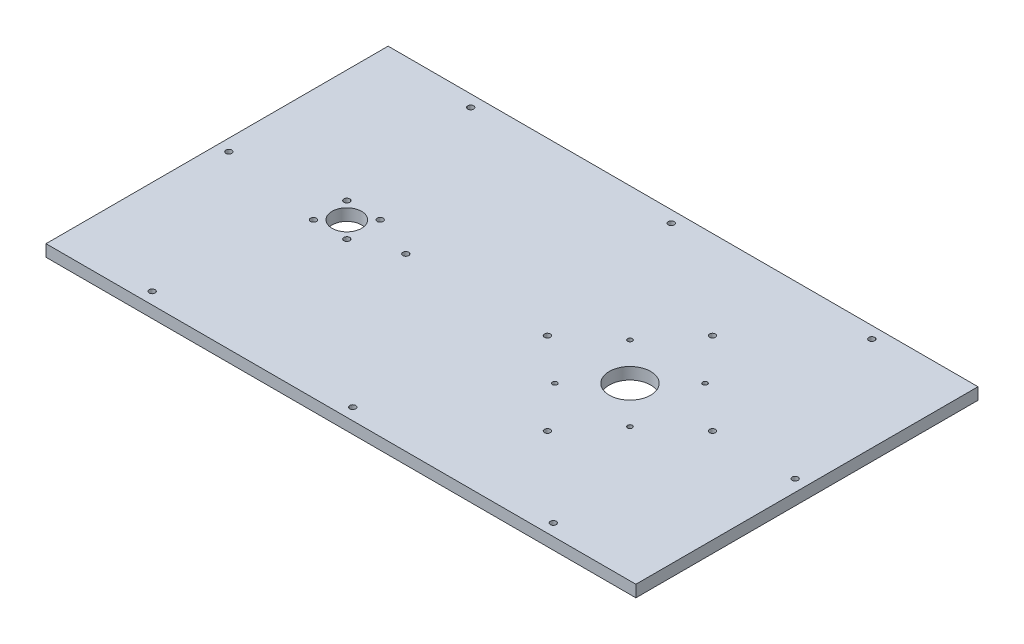
ISO-10303-21;
HEADER;
FILE_DESCRIPTION(('STEP AP214'),'2;1');
FILE_NAME('part.step','',(''),(''),'','','');
FILE_SCHEMA(('AUTOMOTIVE_DESIGN { 1 0 10303 214 1 1 1 1 }'));
ENDSEC;
DATA;
#1=APPLICATION_CONTEXT('core data for automotive mechanical design processes');
#2=APPLICATION_PROTOCOL_DEFINITION('international standard','automotive_design',2000,#1);
#3=PRODUCT_CONTEXT('',#1,'mechanical');
#4=PRODUCT('Part','Part','',(#3));
#5=PRODUCT_RELATED_PRODUCT_CATEGORY('part','',(#4));
#6=PRODUCT_DEFINITION_FORMATION('','',#4);
#7=PRODUCT_DEFINITION_CONTEXT('part definition',#1,'design');
#8=PRODUCT_DEFINITION('design','',#6,#7);
#9=PRODUCT_DEFINITION_SHAPE('','',#8);
#10=(LENGTH_UNIT() NAMED_UNIT(*) SI_UNIT(.MILLI.,.METRE.));
#11=(NAMED_UNIT(*) PLANE_ANGLE_UNIT() SI_UNIT($,.RADIAN.));
#12=(NAMED_UNIT(*) SI_UNIT($,.STERADIAN.) SOLID_ANGLE_UNIT());
#13=UNCERTAINTY_MEASURE_WITH_UNIT(LENGTH_MEASURE(1.E-05),#10,'distance_accuracy_value','');
#14=(GEOMETRIC_REPRESENTATION_CONTEXT(3) GLOBAL_UNCERTAINTY_ASSIGNED_CONTEXT((#13)) GLOBAL_UNIT_ASSIGNED_CONTEXT((#10,
#11,#12)) REPRESENTATION_CONTEXT('',''));
#15=CARTESIAN_POINT('',(0.,0.,0.));
#16=DIRECTION('',(0.,0.,1.));
#17=DIRECTION('',(1.,0.,0.));
#18=AXIS2_PLACEMENT_3D('',#15,#16,#17);
#19=CARTESIAN_POINT('',(0.,10.,0.));
#20=DIRECTION('',(0.,-1.,0.));
#21=DIRECTION('',(0.,0.,-1.));
#22=AXIS2_PLACEMENT_3D('',#19,#20,#21);
#23=PLANE('',#22);
#24=DIRECTION('',(0.,0.,-1.));
#25=VECTOR('',#24,1.);
#26=CARTESIAN_POINT('',(250.,10.,145.));
#27=LINE('',#26,#25);
#28=CARTESIAN_POINT('',(250.,10.,145.));
#29=VERTEX_POINT('',#28);
#30=CARTESIAN_POINT('',(250.,10.,-145.));
#31=VERTEX_POINT('',#30);
#32=EDGE_CURVE('E85',#29,#31,#27,.T.);
#33=ORIENTED_EDGE('',*,*,#32,.T.);
#34=DIRECTION('',(-1.,0.,0.));
#35=VECTOR('',#34,1.);
#36=CARTESIAN_POINT('',(-250.,10.,-145.));
#37=LINE('',#36,#35);
#38=CARTESIAN_POINT('',(-250.,10.,-145.));
#39=VERTEX_POINT('',#38);
#40=EDGE_CURVE('E80',#31,#39,#37,.T.);
#41=ORIENTED_EDGE('',*,*,#40,.T.);
#42=DIRECTION('',(0.,0.,1.));
#43=VECTOR('',#42,1.);
#44=CARTESIAN_POINT('',(-250.,10.,145.));
#45=LINE('',#44,#43);
#46=CARTESIAN_POINT('',(-250.,10.,145.));
#47=VERTEX_POINT('',#46);
#48=EDGE_CURVE('E83',#39,#47,#45,.T.);
#49=ORIENTED_EDGE('',*,*,#48,.T.);
#50=DIRECTION('',(1.,0.,0.));
#51=VECTOR('',#50,1.);
#52=CARTESIAN_POINT('',(-250.,10.,145.));
#53=LINE('',#52,#51);
#54=EDGE_CURVE('E50',#47,#29,#53,.T.);
#55=ORIENTED_EDGE('',*,*,#54,.T.);
#56=EDGE_LOOP('',(#33,#41,#49,#55));
#57=FACE_BOUND('',#56,.T.);
#58=CARTESIAN_POINT('',(-240.,10.,0.));
#59=DIRECTION('',(0.,1.,0.));
#60=DIRECTION('',(0.,0.,1.));
#61=AXIS2_PLACEMENT_3D('',#58,#59,#60);
#62=CIRCLE('',#61,2.5);
#63=CARTESIAN_POINT('',(-240.,10.,2.5));
#64=VERTEX_POINT('',#63);
#65=EDGE_CURVE('E100',#64,#64,#62,.T.);
#66=ORIENTED_EDGE('',*,*,#65,.F.);
#67=EDGE_LOOP('',(#66));
#68=FACE_BOUND('',#67,.T.);
#69=CARTESIAN_POINT('',(-89.9999999999999,10.,0.));
#70=DIRECTION('',(0.,1.,0.));
#71=DIRECTION('',(0.,0.,1.));
#72=AXIS2_PLACEMENT_3D('',#69,#70,#71);
#73=CIRCLE('',#72,2.5);
#74=CARTESIAN_POINT('',(-89.9999999999999,10.,2.5));
#75=VERTEX_POINT('',#74);
#76=EDGE_CURVE('E115',#75,#75,#73,.T.);
#77=ORIENTED_EDGE('',*,*,#76,.F.);
#78=EDGE_LOOP('',(#77));
#79=FACE_BOUND('',#78,.T.);
#80=CARTESIAN_POINT('',(-170.,10.,135.));
#81=DIRECTION('',(0.,1.,0.));
#82=DIRECTION('',(0.,0.,1.));
#83=AXIS2_PLACEMENT_3D('',#80,#81,#82);
#84=CIRCLE('',#83,2.5);
#85=CARTESIAN_POINT('',(-170.,10.,137.5));
#86=VERTEX_POINT('',#85);
#87=EDGE_CURVE('E121',#86,#86,#84,.T.);
#88=ORIENTED_EDGE('',*,*,#87,.F.);
#89=EDGE_LOOP('',(#88));
#90=FACE_BOUND('',#89,.T.);
#91=CARTESIAN_POINT('',(-170.,10.,-135.));
#92=DIRECTION('',(0.,1.,0.));
#93=DIRECTION('',(0.,0.,1.));
#94=AXIS2_PLACEMENT_3D('',#91,#92,#93);
#95=CIRCLE('',#94,2.5);
#96=CARTESIAN_POINT('',(-170.,10.,-132.5));
#97=VERTEX_POINT('',#96);
#98=EDGE_CURVE('E127',#97,#97,#95,.T.);
#99=ORIENTED_EDGE('',*,*,#98,.F.);
#100=EDGE_LOOP('',(#99));
#101=FACE_BOUND('',#100,.T.);
#102=CARTESIAN_POINT('',(170.,10.,-135.));
#103=DIRECTION('',(0.,1.,0.));
#104=DIRECTION('',(0.,0.,1.));
#105=AXIS2_PLACEMENT_3D('',#102,#103,#104);
#106=CIRCLE('',#105,2.5);
#107=CARTESIAN_POINT('',(170.,10.,-132.5));
#108=VERTEX_POINT('',#107);
#109=EDGE_CURVE('E133',#108,#108,#106,.T.);
#110=ORIENTED_EDGE('',*,*,#109,.F.);
#111=EDGE_LOOP('',(#110));
#112=FACE_BOUND('',#111,.T.);
#113=CARTESIAN_POINT('',(240.,10.,0.));
#114=DIRECTION('',(0.,1.,0.));
#115=DIRECTION('',(0.,0.,1.));
#116=AXIS2_PLACEMENT_3D('',#113,#114,#115);
#117=CIRCLE('',#116,2.5);
#118=CARTESIAN_POINT('',(240.,10.,2.5));
#119=VERTEX_POINT('',#118);
#120=EDGE_CURVE('E139',#119,#119,#117,.T.);
#121=ORIENTED_EDGE('',*,*,#120,.F.);
#122=EDGE_LOOP('',(#121));
#123=FACE_BOUND('',#122,.T.);
#124=CARTESIAN_POINT('',(170.,10.,135.));
#125=DIRECTION('',(0.,1.,0.));
#126=DIRECTION('',(0.,0.,1.));
#127=AXIS2_PLACEMENT_3D('',#124,#125,#126);
#128=CIRCLE('',#127,2.5);
#129=CARTESIAN_POINT('',(170.,10.,137.5));
#130=VERTEX_POINT('',#129);
#131=EDGE_CURVE('E145',#130,#130,#128,.T.);
#132=ORIENTED_EDGE('',*,*,#131,.F.);
#133=EDGE_LOOP('',(#132));
#134=FACE_BOUND('',#133,.T.);
#135=CARTESIAN_POINT('',(1.11022302462516E-13,10.,-135.));
#136=DIRECTION('',(0.,1.,0.));
#137=DIRECTION('',(0.,0.,1.));
#138=AXIS2_PLACEMENT_3D('',#135,#136,#137);
#139=CIRCLE('',#138,2.5);
#140=CARTESIAN_POINT('',(1.11022302462516E-13,10.,-132.5));
#141=VERTEX_POINT('',#140);
#142=EDGE_CURVE('E151',#141,#141,#139,.T.);
#143=ORIENTED_EDGE('',*,*,#142,.F.);
#144=EDGE_LOOP('',(#143));
#145=FACE_BOUND('',#144,.T.);
#146=CARTESIAN_POINT('',(1.11022302462516E-13,10.,135.));
#147=DIRECTION('',(0.,1.,0.));
#148=DIRECTION('',(0.,0.,1.));
#149=AXIS2_PLACEMENT_3D('',#146,#147,#148);
#150=CIRCLE('',#149,2.5);
#151=CARTESIAN_POINT('',(1.11022302462516E-13,10.,137.5));
#152=VERTEX_POINT('',#151);
#153=EDGE_CURVE('E157',#152,#152,#150,.T.);
#154=ORIENTED_EDGE('',*,*,#153,.F.);
#155=EDGE_LOOP('',(#154));
#156=FACE_BOUND('',#155,.T.);
#157=CARTESIAN_POINT('',(100.,10.,0.));
#158=DIRECTION('',(0.,1.,0.));
#159=DIRECTION('',(0.,0.,1.));
#160=AXIS2_PLACEMENT_3D('',#157,#158,#159);
#161=CIRCLE('',#160,17.5);
#162=CARTESIAN_POINT('',(100.,10.,17.5));
#163=VERTEX_POINT('',#162);
#164=EDGE_CURVE('E163',#163,#163,#161,.T.);
#165=ORIENTED_EDGE('',*,*,#164,.F.);
#166=EDGE_LOOP('',(#165));
#167=FACE_BOUND('',#166,.T.);
#168=CARTESIAN_POINT('',(-140.,10.,0.));
#169=DIRECTION('',(0.,1.,0.));
#170=DIRECTION('',(0.,0.,1.));
#171=AXIS2_PLACEMENT_3D('',#168,#169,#170);
#172=CIRCLE('',#171,12.5);
#173=CARTESIAN_POINT('',(-140.,10.,12.5));
#174=VERTEX_POINT('',#173);
#175=EDGE_CURVE('E169',#174,#174,#172,.T.);
#176=ORIENTED_EDGE('',*,*,#175,.F.);
#177=EDGE_LOOP('',(#176));
#178=FACE_BOUND('',#177,.T.);
#179=CARTESIAN_POINT('',(-125.857864376269,10.,-14.142135623731));
#180=DIRECTION('',(0.,1.,0.));
#181=DIRECTION('',(0.,0.,1.));
#182=AXIS2_PLACEMENT_3D('',#179,#180,#181);
#183=CIRCLE('',#182,2.5);
#184=CARTESIAN_POINT('',(-125.857864376269,10.,-11.642135623731));
#185=VERTEX_POINT('',#184);
#186=EDGE_CURVE('E175',#185,#185,#183,.T.);
#187=ORIENTED_EDGE('',*,*,#186,.F.);
#188=EDGE_LOOP('',(#187));
#189=FACE_BOUND('',#188,.T.);
#190=CARTESIAN_POINT('',(170.,10.,0.));
#191=DIRECTION('',(0.,1.,0.));
#192=DIRECTION('',(0.,0.,1.));
#193=AXIS2_PLACEMENT_3D('',#190,#191,#192);
#194=CIRCLE('',#193,2.5);
#195=CARTESIAN_POINT('',(170.,10.,2.5));
#196=VERTEX_POINT('',#195);
#197=EDGE_CURVE('E181',#196,#196,#194,.T.);
#198=ORIENTED_EDGE('',*,*,#197,.F.);
#199=EDGE_LOOP('',(#198));
#200=FACE_BOUND('',#199,.T.);
#201=CARTESIAN_POINT('',(-125.857864376269,10.,14.142135623731));
#202=DIRECTION('',(0.,1.,0.));
#203=DIRECTION('',(0.,0.,1.));
#204=AXIS2_PLACEMENT_3D('',#201,#202,#203);
#205=CIRCLE('',#204,2.5);
#206=CARTESIAN_POINT('',(-125.857864376269,10.,16.642135623731));
#207=VERTEX_POINT('',#206);
#208=EDGE_CURVE('E187',#207,#207,#205,.T.);
#209=ORIENTED_EDGE('',*,*,#208,.F.);
#210=EDGE_LOOP('',(#209));
#211=FACE_BOUND('',#210,.T.);
#212=CARTESIAN_POINT('',(-154.14213562373,10.,14.1421356237314));
#213=DIRECTION('',(0.,1.,0.));
#214=DIRECTION('',(0.,0.,1.));
#215=AXIS2_PLACEMENT_3D('',#212,#213,#214);
#216=CIRCLE('',#215,2.5);
#217=CARTESIAN_POINT('',(-154.14213562373,10.,16.6421356237314));
#218=VERTEX_POINT('',#217);
#219=EDGE_CURVE('E193',#218,#218,#216,.T.);
#220=ORIENTED_EDGE('',*,*,#219,.F.);
#221=EDGE_LOOP('',(#220));
#222=FACE_BOUND('',#221,.T.);
#223=CARTESIAN_POINT('',(-154.142135623731,10.,-14.1421356237306));
#224=DIRECTION('',(0.,1.,0.));
#225=DIRECTION('',(0.,0.,1.));
#226=AXIS2_PLACEMENT_3D('',#223,#224,#225);
#227=CIRCLE('',#226,2.5);
#228=CARTESIAN_POINT('',(-154.142135623731,10.,-11.6421356237306));
#229=VERTEX_POINT('',#228);
#230=EDGE_CURVE('E199',#229,#229,#227,.T.);
#231=ORIENTED_EDGE('',*,*,#230,.F.);
#232=EDGE_LOOP('',(#231));
#233=FACE_BOUND('',#232,.T.);
#234=CARTESIAN_POINT('',(131.819805153395,10.,-31.8198051533947));
#235=DIRECTION('',(0.,1.,0.));
#236=DIRECTION('',(0.,0.,1.));
#237=AXIS2_PLACEMENT_3D('',#234,#235,#236);
#238=CIRCLE('',#237,1.99999999999997);
#239=CARTESIAN_POINT('',(131.819805153395,10.,-29.8198051533947));
#240=VERTEX_POINT('',#239);
#241=EDGE_CURVE('E205',#240,#240,#238,.T.);
#242=ORIENTED_EDGE('',*,*,#241,.F.);
#243=EDGE_LOOP('',(#242));
#244=FACE_BOUND('',#243,.T.);
#245=CARTESIAN_POINT('',(99.9999999999999,10.,70.));
#246=DIRECTION('',(0.,1.,0.));
#247=DIRECTION('',(0.,0.,1.));
#248=AXIS2_PLACEMENT_3D('',#245,#246,#247);
#249=CIRCLE('',#248,2.5);
#250=CARTESIAN_POINT('',(99.9999999999999,10.,72.5));
#251=VERTEX_POINT('',#250);
#252=EDGE_CURVE('E211',#251,#251,#249,.T.);
#253=ORIENTED_EDGE('',*,*,#252,.F.);
#254=EDGE_LOOP('',(#253));
#255=FACE_BOUND('',#254,.T.);
#256=CARTESIAN_POINT('',(30.0000000000001,10.,-5.05952442626102E-13));
#257=DIRECTION('',(0.,1.,0.));
#258=DIRECTION('',(0.,0.,1.));
#259=AXIS2_PLACEMENT_3D('',#256,#257,#258);
#260=CIRCLE('',#259,2.49999999999999);
#261=CARTESIAN_POINT('',(30.0000000000001,10.,2.49999999999948));
#262=VERTEX_POINT('',#261);
#263=EDGE_CURVE('E217',#262,#262,#260,.T.);
#264=ORIENTED_EDGE('',*,*,#263,.F.);
#265=EDGE_LOOP('',(#264));
#266=FACE_BOUND('',#265,.T.);
#267=CARTESIAN_POINT('',(100.000000000001,10.,-70.));
#268=DIRECTION('',(0.,1.,0.));
#269=DIRECTION('',(0.,0.,1.));
#270=AXIS2_PLACEMENT_3D('',#267,#268,#269);
#271=CIRCLE('',#270,2.49999999999999);
#272=CARTESIAN_POINT('',(100.000000000001,10.,-67.5));
#273=VERTEX_POINT('',#272);
#274=EDGE_CURVE('E223',#273,#273,#271,.T.);
#275=ORIENTED_EDGE('',*,*,#274,.F.);
#276=EDGE_LOOP('',(#275));
#277=FACE_BOUND('',#276,.T.);
#278=CARTESIAN_POINT('',(131.819805153396,10.,31.8198051533947));
#279=DIRECTION('',(0.,1.,0.));
#280=DIRECTION('',(0.,0.,1.));
#281=AXIS2_PLACEMENT_3D('',#278,#279,#280);
#282=CIRCLE('',#281,1.99999999999997);
#283=CARTESIAN_POINT('',(131.819805153396,10.,33.8198051533947));
#284=VERTEX_POINT('',#283);
#285=EDGE_CURVE('E229',#284,#284,#282,.T.);
#286=ORIENTED_EDGE('',*,*,#285,.F.);
#287=EDGE_LOOP('',(#286));
#288=FACE_BOUND('',#287,.T.);
#289=CARTESIAN_POINT('',(68.1801948466062,10.,31.8198051533954));
#290=DIRECTION('',(0.,1.,0.));
#291=DIRECTION('',(0.,0.,1.));
#292=AXIS2_PLACEMENT_3D('',#289,#290,#291);
#293=CIRCLE('',#292,1.99999999999996);
#294=CARTESIAN_POINT('',(68.1801948466062,10.,33.8198051533953));
#295=VERTEX_POINT('',#294);
#296=EDGE_CURVE('E235',#295,#295,#293,.T.);
#297=ORIENTED_EDGE('',*,*,#296,.F.);
#298=EDGE_LOOP('',(#297));
#299=FACE_BOUND('',#298,.T.);
#300=CARTESIAN_POINT('',(68.1801948466058,10.,-31.819805153394));
#301=DIRECTION('',(0.,1.,0.));
#302=DIRECTION('',(0.,0.,1.));
#303=AXIS2_PLACEMENT_3D('',#300,#301,#302);
#304=CIRCLE('',#303,1.99999999999996);
#305=CARTESIAN_POINT('',(68.1801948466058,10.,-29.8198051533941));
#306=VERTEX_POINT('',#305);
#307=EDGE_CURVE('E241',#306,#306,#304,.T.);
#308=ORIENTED_EDGE('',*,*,#307,.F.);
#309=EDGE_LOOP('',(#308));
#310=FACE_BOUND('',#309,.T.);
#311=ADVANCED_FACE('F33',(#57,#68,#79,#90,#101,#112,#123,#134,#145,#156,#167,#178,#189,#200,
#211,#222,#233,#244,#255,#266,#277,#288,#299,#310),#23,.F.);
#312=CARTESIAN_POINT('',(0.,0.,0.));
#313=DIRECTION('',(0.,-1.,0.));
#314=DIRECTION('',(0.,0.,-1.));
#315=AXIS2_PLACEMENT_3D('',#312,#313,#314);
#316=PLANE('',#315);
#317=CARTESIAN_POINT('',(68.1801948466062,0.,31.8198051533954));
#318=DIRECTION('',(0.,1.,0.));
#319=DIRECTION('',(0.,0.,1.));
#320=AXIS2_PLACEMENT_3D('',#317,#318,#319);
#321=CIRCLE('',#320,1.99999999999996);
#322=CARTESIAN_POINT('',(68.1801948466062,0.,33.8198051533953));
#323=VERTEX_POINT('',#322);
#324=EDGE_CURVE('E238',#323,#323,#321,.T.);
#325=ORIENTED_EDGE('',*,*,#324,.T.);
#326=EDGE_LOOP('',(#325));
#327=FACE_BOUND('',#326,.T.);
#328=CARTESIAN_POINT('',(100.000000000001,0.,-70.));
#329=DIRECTION('',(0.,1.,0.));
#330=DIRECTION('',(0.,0.,1.));
#331=AXIS2_PLACEMENT_3D('',#328,#329,#330);
#332=CIRCLE('',#331,2.49999999999999);
#333=CARTESIAN_POINT('',(100.000000000001,0.,-67.5));
#334=VERTEX_POINT('',#333);
#335=EDGE_CURVE('E226',#334,#334,#332,.T.);
#336=ORIENTED_EDGE('',*,*,#335,.T.);
#337=EDGE_LOOP('',(#336));
#338=FACE_BOUND('',#337,.T.);
#339=CARTESIAN_POINT('',(99.9999999999999,0.,70.));
#340=DIRECTION('',(0.,1.,0.));
#341=DIRECTION('',(0.,0.,1.));
#342=AXIS2_PLACEMENT_3D('',#339,#340,#341);
#343=CIRCLE('',#342,2.5);
#344=CARTESIAN_POINT('',(99.9999999999999,0.,72.5));
#345=VERTEX_POINT('',#344);
#346=EDGE_CURVE('E214',#345,#345,#343,.T.);
#347=ORIENTED_EDGE('',*,*,#346,.T.);
#348=EDGE_LOOP('',(#347));
#349=FACE_BOUND('',#348,.T.);
#350=CARTESIAN_POINT('',(-154.142135623731,0.,-14.1421356237306));
#351=DIRECTION('',(0.,1.,0.));
#352=DIRECTION('',(0.,0.,1.));
#353=AXIS2_PLACEMENT_3D('',#350,#351,#352);
#354=CIRCLE('',#353,2.5);
#355=CARTESIAN_POINT('',(-154.142135623731,0.,-11.6421356237306));
#356=VERTEX_POINT('',#355);
#357=EDGE_CURVE('E202',#356,#356,#354,.T.);
#358=ORIENTED_EDGE('',*,*,#357,.T.);
#359=EDGE_LOOP('',(#358));
#360=FACE_BOUND('',#359,.T.);
#361=CARTESIAN_POINT('',(-125.857864376269,0.,14.142135623731));
#362=DIRECTION('',(0.,1.,0.));
#363=DIRECTION('',(0.,0.,1.));
#364=AXIS2_PLACEMENT_3D('',#361,#362,#363);
#365=CIRCLE('',#364,2.5);
#366=CARTESIAN_POINT('',(-125.857864376269,0.,16.642135623731));
#367=VERTEX_POINT('',#366);
#368=EDGE_CURVE('E190',#367,#367,#365,.T.);
#369=ORIENTED_EDGE('',*,*,#368,.T.);
#370=EDGE_LOOP('',(#369));
#371=FACE_BOUND('',#370,.T.);
#372=CARTESIAN_POINT('',(-125.857864376269,0.,-14.142135623731));
#373=DIRECTION('',(0.,1.,0.));
#374=DIRECTION('',(0.,0.,1.));
#375=AXIS2_PLACEMENT_3D('',#372,#373,#374);
#376=CIRCLE('',#375,2.5);
#377=CARTESIAN_POINT('',(-125.857864376269,0.,-11.642135623731));
#378=VERTEX_POINT('',#377);
#379=EDGE_CURVE('E178',#378,#378,#376,.T.);
#380=ORIENTED_EDGE('',*,*,#379,.T.);
#381=EDGE_LOOP('',(#380));
#382=FACE_BOUND('',#381,.T.);
#383=CARTESIAN_POINT('',(100.,0.,0.));
#384=DIRECTION('',(0.,1.,0.));
#385=DIRECTION('',(0.,0.,1.));
#386=AXIS2_PLACEMENT_3D('',#383,#384,#385);
#387=CIRCLE('',#386,17.5);
#388=CARTESIAN_POINT('',(100.,0.,17.5));
#389=VERTEX_POINT('',#388);
#390=EDGE_CURVE('E166',#389,#389,#387,.T.);
#391=ORIENTED_EDGE('',*,*,#390,.T.);
#392=EDGE_LOOP('',(#391));
#393=FACE_BOUND('',#392,.T.);
#394=CARTESIAN_POINT('',(1.11022302462516E-13,0.,-135.));
#395=DIRECTION('',(0.,1.,0.));
#396=DIRECTION('',(0.,0.,1.));
#397=AXIS2_PLACEMENT_3D('',#394,#395,#396);
#398=CIRCLE('',#397,2.5);
#399=CARTESIAN_POINT('',(1.11022302462516E-13,0.,-132.5));
#400=VERTEX_POINT('',#399);
#401=EDGE_CURVE('E154',#400,#400,#398,.T.);
#402=ORIENTED_EDGE('',*,*,#401,.T.);
#403=EDGE_LOOP('',(#402));
#404=FACE_BOUND('',#403,.T.);
#405=CARTESIAN_POINT('',(240.,0.,0.));
#406=DIRECTION('',(0.,1.,0.));
#407=DIRECTION('',(0.,0.,1.));
#408=AXIS2_PLACEMENT_3D('',#405,#406,#407);
#409=CIRCLE('',#408,2.5);
#410=CARTESIAN_POINT('',(240.,0.,2.5));
#411=VERTEX_POINT('',#410);
#412=EDGE_CURVE('E142',#411,#411,#409,.T.);
#413=ORIENTED_EDGE('',*,*,#412,.T.);
#414=EDGE_LOOP('',(#413));
#415=FACE_BOUND('',#414,.T.);
#416=CARTESIAN_POINT('',(-170.,0.,-135.));
#417=DIRECTION('',(0.,1.,0.));
#418=DIRECTION('',(0.,0.,1.));
#419=AXIS2_PLACEMENT_3D('',#416,#417,#418);
#420=CIRCLE('',#419,2.5);
#421=CARTESIAN_POINT('',(-170.,0.,-132.5));
#422=VERTEX_POINT('',#421);
#423=EDGE_CURVE('E130',#422,#422,#420,.T.);
#424=ORIENTED_EDGE('',*,*,#423,.T.);
#425=EDGE_LOOP('',(#424));
#426=FACE_BOUND('',#425,.T.);
#427=CARTESIAN_POINT('',(-89.9999999999999,0.,0.));
#428=DIRECTION('',(0.,1.,0.));
#429=DIRECTION('',(0.,0.,1.));
#430=AXIS2_PLACEMENT_3D('',#427,#428,#429);
#431=CIRCLE('',#430,2.5);
#432=CARTESIAN_POINT('',(-89.9999999999999,0.,2.5));
#433=VERTEX_POINT('',#432);
#434=EDGE_CURVE('E118',#433,#433,#431,.T.);
#435=ORIENTED_EDGE('',*,*,#434,.T.);
#436=EDGE_LOOP('',(#435));
#437=FACE_BOUND('',#436,.T.);
#438=DIRECTION('',(0.,0.,-1.));
#439=VECTOR('',#438,1.);
#440=CARTESIAN_POINT('',(250.,0.,145.));
#441=LINE('',#440,#439);
#442=CARTESIAN_POINT('',(250.,0.,145.));
#443=VERTEX_POINT('',#442);
#444=CARTESIAN_POINT('',(250.,0.,-145.));
#445=VERTEX_POINT('',#444);
#446=EDGE_CURVE('E97',#443,#445,#441,.T.);
#447=ORIENTED_EDGE('',*,*,#446,.F.);
#448=DIRECTION('',(1.,0.,0.));
#449=VECTOR('',#448,1.);
#450=CARTESIAN_POINT('',(-250.,0.,145.));
#451=LINE('',#450,#449);
#452=CARTESIAN_POINT('',(-250.,0.,145.));
#453=VERTEX_POINT('',#452);
#454=EDGE_CURVE('E73',#453,#443,#451,.T.);
#455=ORIENTED_EDGE('',*,*,#454,.F.);
#456=DIRECTION('',(0.,0.,1.));
#457=VECTOR('',#456,1.);
#458=CARTESIAN_POINT('',(-250.,0.,145.));
#459=LINE('',#458,#457);
#460=CARTESIAN_POINT('',(-250.,0.,-145.));
#461=VERTEX_POINT('',#460);
#462=EDGE_CURVE('E67',#461,#453,#459,.T.);
#463=ORIENTED_EDGE('',*,*,#462,.F.);
#464=DIRECTION('',(-1.,0.,0.));
#465=VECTOR('',#464,1.);
#466=CARTESIAN_POINT('',(-250.,0.,-145.));
#467=LINE('',#466,#465);
#468=EDGE_CURVE('E89',#445,#461,#467,.T.);
#469=ORIENTED_EDGE('',*,*,#468,.F.);
#470=EDGE_LOOP('',(#447,#455,#463,#469));
#471=FACE_BOUND('',#470,.T.);
#472=CARTESIAN_POINT('',(-240.,0.,0.));
#473=DIRECTION('',(0.,1.,0.));
#474=DIRECTION('',(0.,0.,1.));
#475=AXIS2_PLACEMENT_3D('',#472,#473,#474);
#476=CIRCLE('',#475,2.5);
#477=CARTESIAN_POINT('',(-240.,0.,2.5));
#478=VERTEX_POINT('',#477);
#479=EDGE_CURVE('E112',#478,#478,#476,.T.);
#480=ORIENTED_EDGE('',*,*,#479,.T.);
#481=EDGE_LOOP('',(#480));
#482=FACE_BOUND('',#481,.T.);
#483=CARTESIAN_POINT('',(-170.,0.,135.));
#484=DIRECTION('',(0.,1.,0.));
#485=DIRECTION('',(0.,0.,1.));
#486=AXIS2_PLACEMENT_3D('',#483,#484,#485);
#487=CIRCLE('',#486,2.5);
#488=CARTESIAN_POINT('',(-170.,0.,137.5));
#489=VERTEX_POINT('',#488);
#490=EDGE_CURVE('E124',#489,#489,#487,.T.);
#491=ORIENTED_EDGE('',*,*,#490,.T.);
#492=EDGE_LOOP('',(#491));
#493=FACE_BOUND('',#492,.T.);
#494=CARTESIAN_POINT('',(170.,0.,-135.));
#495=DIRECTION('',(0.,1.,0.));
#496=DIRECTION('',(0.,0.,1.));
#497=AXIS2_PLACEMENT_3D('',#494,#495,#496);
#498=CIRCLE('',#497,2.5);
#499=CARTESIAN_POINT('',(170.,0.,-132.5));
#500=VERTEX_POINT('',#499);
#501=EDGE_CURVE('E136',#500,#500,#498,.T.);
#502=ORIENTED_EDGE('',*,*,#501,.T.);
#503=EDGE_LOOP('',(#502));
#504=FACE_BOUND('',#503,.T.);
#505=CARTESIAN_POINT('',(170.,0.,135.));
#506=DIRECTION('',(0.,1.,0.));
#507=DIRECTION('',(0.,0.,1.));
#508=AXIS2_PLACEMENT_3D('',#505,#506,#507);
#509=CIRCLE('',#508,2.5);
#510=CARTESIAN_POINT('',(170.,0.,137.5));
#511=VERTEX_POINT('',#510);
#512=EDGE_CURVE('E148',#511,#511,#509,.T.);
#513=ORIENTED_EDGE('',*,*,#512,.T.);
#514=EDGE_LOOP('',(#513));
#515=FACE_BOUND('',#514,.T.);
#516=CARTESIAN_POINT('',(1.11022302462516E-13,0.,135.));
#517=DIRECTION('',(0.,1.,0.));
#518=DIRECTION('',(0.,0.,1.));
#519=AXIS2_PLACEMENT_3D('',#516,#517,#518);
#520=CIRCLE('',#519,2.5);
#521=CARTESIAN_POINT('',(1.11022302462516E-13,0.,137.5));
#522=VERTEX_POINT('',#521);
#523=EDGE_CURVE('E160',#522,#522,#520,.T.);
#524=ORIENTED_EDGE('',*,*,#523,.T.);
#525=EDGE_LOOP('',(#524));
#526=FACE_BOUND('',#525,.T.);
#527=CARTESIAN_POINT('',(-140.,0.,0.));
#528=DIRECTION('',(0.,1.,0.));
#529=DIRECTION('',(0.,0.,1.));
#530=AXIS2_PLACEMENT_3D('',#527,#528,#529);
#531=CIRCLE('',#530,12.5);
#532=CARTESIAN_POINT('',(-140.,0.,12.5));
#533=VERTEX_POINT('',#532);
#534=EDGE_CURVE('E172',#533,#533,#531,.T.);
#535=ORIENTED_EDGE('',*,*,#534,.T.);
#536=EDGE_LOOP('',(#535));
#537=FACE_BOUND('',#536,.T.);
#538=CARTESIAN_POINT('',(170.,0.,0.));
#539=DIRECTION('',(0.,1.,0.));
#540=DIRECTION('',(0.,0.,1.));
#541=AXIS2_PLACEMENT_3D('',#538,#539,#540);
#542=CIRCLE('',#541,2.5);
#543=CARTESIAN_POINT('',(170.,0.,2.5));
#544=VERTEX_POINT('',#543);
#545=EDGE_CURVE('E184',#544,#544,#542,.T.);
#546=ORIENTED_EDGE('',*,*,#545,.T.);
#547=EDGE_LOOP('',(#546));
#548=FACE_BOUND('',#547,.T.);
#549=CARTESIAN_POINT('',(-154.14213562373,0.,14.1421356237314));
#550=DIRECTION('',(0.,1.,0.));
#551=DIRECTION('',(0.,0.,1.));
#552=AXIS2_PLACEMENT_3D('',#549,#550,#551);
#553=CIRCLE('',#552,2.5);
#554=CARTESIAN_POINT('',(-154.14213562373,0.,16.6421356237314));
#555=VERTEX_POINT('',#554);
#556=EDGE_CURVE('E196',#555,#555,#553,.T.);
#557=ORIENTED_EDGE('',*,*,#556,.T.);
#558=EDGE_LOOP('',(#557));
#559=FACE_BOUND('',#558,.T.);
#560=CARTESIAN_POINT('',(131.819805153395,0.,-31.8198051533947));
#561=DIRECTION('',(0.,1.,0.));
#562=DIRECTION('',(0.,0.,1.));
#563=AXIS2_PLACEMENT_3D('',#560,#561,#562);
#564=CIRCLE('',#563,1.99999999999997);
#565=CARTESIAN_POINT('',(131.819805153395,0.,-29.8198051533947));
#566=VERTEX_POINT('',#565);
#567=EDGE_CURVE('E208',#566,#566,#564,.T.);
#568=ORIENTED_EDGE('',*,*,#567,.T.);
#569=EDGE_LOOP('',(#568));
#570=FACE_BOUND('',#569,.T.);
#571=CARTESIAN_POINT('',(30.0000000000001,0.,-5.05952442626102E-13));
#572=DIRECTION('',(0.,1.,0.));
#573=DIRECTION('',(0.,0.,1.));
#574=AXIS2_PLACEMENT_3D('',#571,#572,#573);
#575=CIRCLE('',#574,2.49999999999999);
#576=CARTESIAN_POINT('',(30.0000000000001,0.,2.49999999999948));
#577=VERTEX_POINT('',#576);
#578=EDGE_CURVE('E220',#577,#577,#575,.T.);
#579=ORIENTED_EDGE('',*,*,#578,.T.);
#580=EDGE_LOOP('',(#579));
#581=FACE_BOUND('',#580,.T.);
#582=CARTESIAN_POINT('',(131.819805153396,0.,31.8198051533947));
#583=DIRECTION('',(0.,1.,0.));
#584=DIRECTION('',(0.,0.,1.));
#585=AXIS2_PLACEMENT_3D('',#582,#583,#584);
#586=CIRCLE('',#585,1.99999999999997);
#587=CARTESIAN_POINT('',(131.819805153396,0.,33.8198051533947));
#588=VERTEX_POINT('',#587);
#589=EDGE_CURVE('E232',#588,#588,#586,.T.);
#590=ORIENTED_EDGE('',*,*,#589,.T.);
#591=EDGE_LOOP('',(#590));
#592=FACE_BOUND('',#591,.T.);
#593=CARTESIAN_POINT('',(68.1801948466058,0.,-31.819805153394));
#594=DIRECTION('',(0.,1.,0.));
#595=DIRECTION('',(0.,0.,1.));
#596=AXIS2_PLACEMENT_3D('',#593,#594,#595);
#597=CIRCLE('',#596,1.99999999999996);
#598=CARTESIAN_POINT('',(68.1801948466058,0.,-29.8198051533941));
#599=VERTEX_POINT('',#598);
#600=EDGE_CURVE('E244',#599,#599,#597,.T.);
#601=ORIENTED_EDGE('',*,*,#600,.T.);
#602=EDGE_LOOP('',(#601));
#603=FACE_BOUND('',#602,.T.);
#604=ADVANCED_FACE('F108',(#327,#338,#349,#360,#371,#382,#393,#404,#415,#426,#437,#471,#482,
#493,#504,#515,#526,#537,#548,#559,#570,#581,#592,#603),#316,.T.);
#605=CARTESIAN_POINT('',(250.,10.,145.));
#606=DIRECTION('',(-1.,0.,0.));
#607=DIRECTION('',(0.,0.,1.));
#608=AXIS2_PLACEMENT_3D('',#605,#606,#607);
#609=PLANE('',#608);
#610=ORIENTED_EDGE('',*,*,#446,.T.);
#611=DIRECTION('',(0.,-1.,0.));
#612=VECTOR('',#611,1.);
#613=CARTESIAN_POINT('',(250.,10.,-145.));
#614=LINE('',#613,#612);
#615=EDGE_CURVE('E11',#31,#445,#614,.T.);
#616=ORIENTED_EDGE('',*,*,#615,.F.);
#617=ORIENTED_EDGE('',*,*,#32,.F.);
#618=DIRECTION('',(0.,-1.,0.));
#619=VECTOR('',#618,1.);
#620=CARTESIAN_POINT('',(250.,10.,145.));
#621=LINE('',#620,#619);
#622=EDGE_CURVE('E93',#29,#443,#621,.T.);
#623=ORIENTED_EDGE('',*,*,#622,.T.);
#624=EDGE_LOOP('',(#610,#616,#617,#623));
#625=FACE_BOUND('',#624,.T.);
#626=ADVANCED_FACE('F35',(#625),#609,.F.);
#627=CARTESIAN_POINT('',(-250.,10.,-145.));
#628=DIRECTION('',(0.,0.,1.));
#629=DIRECTION('',(1.,0.,0.));
#630=AXIS2_PLACEMENT_3D('',#627,#628,#629);
#631=PLANE('',#630);
#632=ORIENTED_EDGE('',*,*,#468,.T.);
#633=DIRECTION('',(0.,-1.,0.));
#634=VECTOR('',#633,1.);
#635=CARTESIAN_POINT('',(-250.,10.,-145.));
#636=LINE('',#635,#634);
#637=EDGE_CURVE('E42',#39,#461,#636,.T.);
#638=ORIENTED_EDGE('',*,*,#637,.F.);
#639=ORIENTED_EDGE('',*,*,#40,.F.);
#640=ORIENTED_EDGE('',*,*,#615,.T.);
#641=EDGE_LOOP('',(#632,#638,#639,#640));
#642=FACE_BOUND('',#641,.T.);
#643=ADVANCED_FACE('F88',(#642),#631,.F.);
#644=CARTESIAN_POINT('',(-250.,10.,145.));
#645=DIRECTION('',(1.,0.,0.));
#646=DIRECTION('',(0.,0.,-1.));
#647=AXIS2_PLACEMENT_3D('',#644,#645,#646);
#648=PLANE('',#647);
#649=ORIENTED_EDGE('',*,*,#462,.T.);
#650=DIRECTION('',(0.,-1.,0.));
#651=VECTOR('',#650,1.);
#652=CARTESIAN_POINT('',(-250.,10.,145.));
#653=LINE('',#652,#651);
#654=EDGE_CURVE('E90',#47,#453,#653,.T.);
#655=ORIENTED_EDGE('',*,*,#654,.F.);
#656=ORIENTED_EDGE('',*,*,#48,.F.);
#657=ORIENTED_EDGE('',*,*,#637,.T.);
#658=EDGE_LOOP('',(#649,#655,#656,#657));
#659=FACE_BOUND('',#658,.T.);
#660=ADVANCED_FACE('F91',(#659),#648,.F.);
#661=CARTESIAN_POINT('',(-250.,10.,145.));
#662=DIRECTION('',(0.,0.,-1.));
#663=DIRECTION('',(-1.,0.,0.));
#664=AXIS2_PLACEMENT_3D('',#661,#662,#663);
#665=PLANE('',#664);
#666=ORIENTED_EDGE('',*,*,#454,.T.);
#667=ORIENTED_EDGE('',*,*,#622,.F.);
#668=ORIENTED_EDGE('',*,*,#54,.F.);
#669=ORIENTED_EDGE('',*,*,#654,.T.);
#670=EDGE_LOOP('',(#666,#667,#668,#669));
#671=FACE_BOUND('',#670,.T.);
#672=ADVANCED_FACE('F105',(#671),#665,.F.);
#673=CARTESIAN_POINT('',(-240.,10.,0.));
#674=DIRECTION('',(0.,-1.,0.));
#675=DIRECTION('',(0.,0.,-1.));
#676=AXIS2_PLACEMENT_3D('',#673,#674,#675);
#677=CYLINDRICAL_SURFACE('',#676,2.5);
#678=ORIENTED_EDGE('',*,*,#65,.T.);
#679=EDGE_LOOP('',(#678));
#680=FACE_BOUND('',#679,.T.);
#681=ORIENTED_EDGE('',*,*,#479,.F.);
#682=EDGE_LOOP('',(#681));
#683=FACE_BOUND('',#682,.T.);
#684=ADVANCED_FACE('F261',(#680,#683),#677,.F.);
#685=CARTESIAN_POINT('',(-89.9999999999999,10.,0.));
#686=DIRECTION('',(0.,-1.,0.));
#687=DIRECTION('',(0.,0.,-1.));
#688=AXIS2_PLACEMENT_3D('',#685,#686,#687);
#689=CYLINDRICAL_SURFACE('',#688,2.5);
#690=ORIENTED_EDGE('',*,*,#76,.T.);
#691=EDGE_LOOP('',(#690));
#692=FACE_BOUND('',#691,.T.);
#693=ORIENTED_EDGE('',*,*,#434,.F.);
#694=EDGE_LOOP('',(#693));
#695=FACE_BOUND('',#694,.T.);
#696=ADVANCED_FACE('F307',(#692,#695),#689,.F.);
#697=CARTESIAN_POINT('',(-170.,10.,135.));
#698=DIRECTION('',(0.,-1.,0.));
#699=DIRECTION('',(0.,0.,-1.));
#700=AXIS2_PLACEMENT_3D('',#697,#698,#699);
#701=CYLINDRICAL_SURFACE('',#700,2.5);
#702=ORIENTED_EDGE('',*,*,#87,.T.);
#703=EDGE_LOOP('',(#702));
#704=FACE_BOUND('',#703,.T.);
#705=ORIENTED_EDGE('',*,*,#490,.F.);
#706=EDGE_LOOP('',(#705));
#707=FACE_BOUND('',#706,.T.);
#708=ADVANCED_FACE('F315',(#704,#707),#701,.F.);
#709=CARTESIAN_POINT('',(-170.,10.,-135.));
#710=DIRECTION('',(0.,-1.,0.));
#711=DIRECTION('',(0.,0.,-1.));
#712=AXIS2_PLACEMENT_3D('',#709,#710,#711);
#713=CYLINDRICAL_SURFACE('',#712,2.5);
#714=ORIENTED_EDGE('',*,*,#98,.T.);
#715=EDGE_LOOP('',(#714));
#716=FACE_BOUND('',#715,.T.);
#717=ORIENTED_EDGE('',*,*,#423,.F.);
#718=EDGE_LOOP('',(#717));
#719=FACE_BOUND('',#718,.T.);
#720=ADVANCED_FACE('F323',(#716,#719),#713,.F.);
#721=CARTESIAN_POINT('',(170.,10.,-135.));
#722=DIRECTION('',(0.,-1.,0.));
#723=DIRECTION('',(0.,0.,-1.));
#724=AXIS2_PLACEMENT_3D('',#721,#722,#723);
#725=CYLINDRICAL_SURFACE('',#724,2.5);
#726=ORIENTED_EDGE('',*,*,#109,.T.);
#727=EDGE_LOOP('',(#726));
#728=FACE_BOUND('',#727,.T.);
#729=ORIENTED_EDGE('',*,*,#501,.F.);
#730=EDGE_LOOP('',(#729));
#731=FACE_BOUND('',#730,.T.);
#732=ADVANCED_FACE('F332',(#728,#731),#725,.F.);
#733=CARTESIAN_POINT('',(240.,10.,0.));
#734=DIRECTION('',(0.,-1.,0.));
#735=DIRECTION('',(0.,0.,-1.));
#736=AXIS2_PLACEMENT_3D('',#733,#734,#735);
#737=CYLINDRICAL_SURFACE('',#736,2.5);
#738=ORIENTED_EDGE('',*,*,#120,.T.);
#739=EDGE_LOOP('',(#738));
#740=FACE_BOUND('',#739,.T.);
#741=ORIENTED_EDGE('',*,*,#412,.F.);
#742=EDGE_LOOP('',(#741));
#743=FACE_BOUND('',#742,.T.);
#744=ADVANCED_FACE('F341',(#740,#743),#737,.F.);
#745=CARTESIAN_POINT('',(170.,10.,135.));
#746=DIRECTION('',(0.,-1.,0.));
#747=DIRECTION('',(0.,0.,-1.));
#748=AXIS2_PLACEMENT_3D('',#745,#746,#747);
#749=CYLINDRICAL_SURFACE('',#748,2.5);
#750=ORIENTED_EDGE('',*,*,#131,.T.);
#751=EDGE_LOOP('',(#750));
#752=FACE_BOUND('',#751,.T.);
#753=ORIENTED_EDGE('',*,*,#512,.F.);
#754=EDGE_LOOP('',(#753));
#755=FACE_BOUND('',#754,.T.);
#756=ADVANCED_FACE('F350',(#752,#755),#749,.F.);
#757=CARTESIAN_POINT('',(1.11022302462516E-13,10.,-135.));
#758=DIRECTION('',(0.,-1.,0.));
#759=DIRECTION('',(0.,0.,-1.));
#760=AXIS2_PLACEMENT_3D('',#757,#758,#759);
#761=CYLINDRICAL_SURFACE('',#760,2.5);
#762=ORIENTED_EDGE('',*,*,#142,.T.);
#763=EDGE_LOOP('',(#762));
#764=FACE_BOUND('',#763,.T.);
#765=ORIENTED_EDGE('',*,*,#401,.F.);
#766=EDGE_LOOP('',(#765));
#767=FACE_BOUND('',#766,.T.);
#768=ADVANCED_FACE('F359',(#764,#767),#761,.F.);
#769=CARTESIAN_POINT('',(1.11022302462516E-13,10.,135.));
#770=DIRECTION('',(0.,-1.,0.));
#771=DIRECTION('',(0.,0.,-1.));
#772=AXIS2_PLACEMENT_3D('',#769,#770,#771);
#773=CYLINDRICAL_SURFACE('',#772,2.5);
#774=ORIENTED_EDGE('',*,*,#153,.T.);
#775=EDGE_LOOP('',(#774));
#776=FACE_BOUND('',#775,.T.);
#777=ORIENTED_EDGE('',*,*,#523,.F.);
#778=EDGE_LOOP('',(#777));
#779=FACE_BOUND('',#778,.T.);
#780=ADVANCED_FACE('F368',(#776,#779),#773,.F.);
#781=CARTESIAN_POINT('',(100.,10.,0.));
#782=DIRECTION('',(0.,-1.,0.));
#783=DIRECTION('',(0.,0.,-1.));
#784=AXIS2_PLACEMENT_3D('',#781,#782,#783);
#785=CYLINDRICAL_SURFACE('',#784,17.5);
#786=ORIENTED_EDGE('',*,*,#164,.T.);
#787=EDGE_LOOP('',(#786));
#788=FACE_BOUND('',#787,.T.);
#789=ORIENTED_EDGE('',*,*,#390,.F.);
#790=EDGE_LOOP('',(#789));
#791=FACE_BOUND('',#790,.T.);
#792=ADVANCED_FACE('F377',(#788,#791),#785,.F.);
#793=CARTESIAN_POINT('',(-140.,10.,0.));
#794=DIRECTION('',(0.,-1.,0.));
#795=DIRECTION('',(0.,0.,-1.));
#796=AXIS2_PLACEMENT_3D('',#793,#794,#795);
#797=CYLINDRICAL_SURFACE('',#796,12.5);
#798=ORIENTED_EDGE('',*,*,#175,.T.);
#799=EDGE_LOOP('',(#798));
#800=FACE_BOUND('',#799,.T.);
#801=ORIENTED_EDGE('',*,*,#534,.F.);
#802=EDGE_LOOP('',(#801));
#803=FACE_BOUND('',#802,.T.);
#804=ADVANCED_FACE('F386',(#800,#803),#797,.F.);
#805=CARTESIAN_POINT('',(-125.857864376269,10.,-14.142135623731));
#806=DIRECTION('',(0.,-1.,0.));
#807=DIRECTION('',(0.,0.,-1.));
#808=AXIS2_PLACEMENT_3D('',#805,#806,#807);
#809=CYLINDRICAL_SURFACE('',#808,2.5);
#810=ORIENTED_EDGE('',*,*,#186,.T.);
#811=EDGE_LOOP('',(#810));
#812=FACE_BOUND('',#811,.T.);
#813=ORIENTED_EDGE('',*,*,#379,.F.);
#814=EDGE_LOOP('',(#813));
#815=FACE_BOUND('',#814,.T.);
#816=ADVANCED_FACE('F395',(#812,#815),#809,.F.);
#817=CARTESIAN_POINT('',(170.,10.,0.));
#818=DIRECTION('',(0.,-1.,0.));
#819=DIRECTION('',(0.,0.,-1.));
#820=AXIS2_PLACEMENT_3D('',#817,#818,#819);
#821=CYLINDRICAL_SURFACE('',#820,2.5);
#822=ORIENTED_EDGE('',*,*,#197,.T.);
#823=EDGE_LOOP('',(#822));
#824=FACE_BOUND('',#823,.T.);
#825=ORIENTED_EDGE('',*,*,#545,.F.);
#826=EDGE_LOOP('',(#825));
#827=FACE_BOUND('',#826,.T.);
#828=ADVANCED_FACE('F404',(#824,#827),#821,.F.);
#829=CARTESIAN_POINT('',(-125.857864376269,10.,14.142135623731));
#830=DIRECTION('',(0.,-1.,0.));
#831=DIRECTION('',(0.,0.,-1.));
#832=AXIS2_PLACEMENT_3D('',#829,#830,#831);
#833=CYLINDRICAL_SURFACE('',#832,2.5);
#834=ORIENTED_EDGE('',*,*,#208,.T.);
#835=EDGE_LOOP('',(#834));
#836=FACE_BOUND('',#835,.T.);
#837=ORIENTED_EDGE('',*,*,#368,.F.);
#838=EDGE_LOOP('',(#837));
#839=FACE_BOUND('',#838,.T.);
#840=ADVANCED_FACE('F413',(#836,#839),#833,.F.);
#841=CARTESIAN_POINT('',(-154.14213562373,10.,14.1421356237314));
#842=DIRECTION('',(0.,-1.,0.));
#843=DIRECTION('',(0.,0.,-1.));
#844=AXIS2_PLACEMENT_3D('',#841,#842,#843);
#845=CYLINDRICAL_SURFACE('',#844,2.5);
#846=ORIENTED_EDGE('',*,*,#219,.T.);
#847=EDGE_LOOP('',(#846));
#848=FACE_BOUND('',#847,.T.);
#849=ORIENTED_EDGE('',*,*,#556,.F.);
#850=EDGE_LOOP('',(#849));
#851=FACE_BOUND('',#850,.T.);
#852=ADVANCED_FACE('F422',(#848,#851),#845,.F.);
#853=CARTESIAN_POINT('',(-154.142135623731,10.,-14.1421356237306));
#854=DIRECTION('',(0.,-1.,0.));
#855=DIRECTION('',(0.,0.,-1.));
#856=AXIS2_PLACEMENT_3D('',#853,#854,#855);
#857=CYLINDRICAL_SURFACE('',#856,2.5);
#858=ORIENTED_EDGE('',*,*,#230,.T.);
#859=EDGE_LOOP('',(#858));
#860=FACE_BOUND('',#859,.T.);
#861=ORIENTED_EDGE('',*,*,#357,.F.);
#862=EDGE_LOOP('',(#861));
#863=FACE_BOUND('',#862,.T.);
#864=ADVANCED_FACE('F431',(#860,#863),#857,.F.);
#865=CARTESIAN_POINT('',(131.819805153395,10.,-31.8198051533947));
#866=DIRECTION('',(0.,-1.,0.));
#867=DIRECTION('',(0.,0.,-1.));
#868=AXIS2_PLACEMENT_3D('',#865,#866,#867);
#869=CYLINDRICAL_SURFACE('',#868,1.99999999999997);
#870=ORIENTED_EDGE('',*,*,#241,.T.);
#871=EDGE_LOOP('',(#870));
#872=FACE_BOUND('',#871,.T.);
#873=ORIENTED_EDGE('',*,*,#567,.F.);
#874=EDGE_LOOP('',(#873));
#875=FACE_BOUND('',#874,.T.);
#876=ADVANCED_FACE('F440',(#872,#875),#869,.F.);
#877=CARTESIAN_POINT('',(99.9999999999999,10.,70.));
#878=DIRECTION('',(0.,-1.,0.));
#879=DIRECTION('',(0.,0.,-1.));
#880=AXIS2_PLACEMENT_3D('',#877,#878,#879);
#881=CYLINDRICAL_SURFACE('',#880,2.5);
#882=ORIENTED_EDGE('',*,*,#252,.T.);
#883=EDGE_LOOP('',(#882));
#884=FACE_BOUND('',#883,.T.);
#885=ORIENTED_EDGE('',*,*,#346,.F.);
#886=EDGE_LOOP('',(#885));
#887=FACE_BOUND('',#886,.T.);
#888=ADVANCED_FACE('F449',(#884,#887),#881,.F.);
#889=CARTESIAN_POINT('',(30.0000000000001,10.,-5.05952442626102E-13));
#890=DIRECTION('',(0.,-1.,0.));
#891=DIRECTION('',(0.,0.,-1.));
#892=AXIS2_PLACEMENT_3D('',#889,#890,#891);
#893=CYLINDRICAL_SURFACE('',#892,2.49999999999999);
#894=ORIENTED_EDGE('',*,*,#263,.T.);
#895=EDGE_LOOP('',(#894));
#896=FACE_BOUND('',#895,.T.);
#897=ORIENTED_EDGE('',*,*,#578,.F.);
#898=EDGE_LOOP('',(#897));
#899=FACE_BOUND('',#898,.T.);
#900=ADVANCED_FACE('F458',(#896,#899),#893,.F.);
#901=CARTESIAN_POINT('',(100.000000000001,10.,-70.));
#902=DIRECTION('',(0.,-1.,0.));
#903=DIRECTION('',(0.,0.,-1.));
#904=AXIS2_PLACEMENT_3D('',#901,#902,#903);
#905=CYLINDRICAL_SURFACE('',#904,2.49999999999999);
#906=ORIENTED_EDGE('',*,*,#274,.T.);
#907=EDGE_LOOP('',(#906));
#908=FACE_BOUND('',#907,.T.);
#909=ORIENTED_EDGE('',*,*,#335,.F.);
#910=EDGE_LOOP('',(#909));
#911=FACE_BOUND('',#910,.T.);
#912=ADVANCED_FACE('F467',(#908,#911),#905,.F.);
#913=CARTESIAN_POINT('',(131.819805153396,10.,31.8198051533947));
#914=DIRECTION('',(0.,-1.,0.));
#915=DIRECTION('',(0.,0.,-1.));
#916=AXIS2_PLACEMENT_3D('',#913,#914,#915);
#917=CYLINDRICAL_SURFACE('',#916,1.99999999999997);
#918=ORIENTED_EDGE('',*,*,#285,.T.);
#919=EDGE_LOOP('',(#918));
#920=FACE_BOUND('',#919,.T.);
#921=ORIENTED_EDGE('',*,*,#589,.F.);
#922=EDGE_LOOP('',(#921));
#923=FACE_BOUND('',#922,.T.);
#924=ADVANCED_FACE('F476',(#920,#923),#917,.F.);
#925=CARTESIAN_POINT('',(68.1801948466062,10.,31.8198051533954));
#926=DIRECTION('',(0.,-1.,0.));
#927=DIRECTION('',(0.,0.,-1.));
#928=AXIS2_PLACEMENT_3D('',#925,#926,#927);
#929=CYLINDRICAL_SURFACE('',#928,1.99999999999996);
#930=ORIENTED_EDGE('',*,*,#296,.T.);
#931=EDGE_LOOP('',(#930));
#932=FACE_BOUND('',#931,.T.);
#933=ORIENTED_EDGE('',*,*,#324,.F.);
#934=EDGE_LOOP('',(#933));
#935=FACE_BOUND('',#934,.T.);
#936=ADVANCED_FACE('F485',(#932,#935),#929,.F.);
#937=CARTESIAN_POINT('',(68.1801948466058,10.,-31.819805153394));
#938=DIRECTION('',(0.,-1.,0.));
#939=DIRECTION('',(0.,0.,-1.));
#940=AXIS2_PLACEMENT_3D('',#937,#938,#939);
#941=CYLINDRICAL_SURFACE('',#940,1.99999999999996);
#942=ORIENTED_EDGE('',*,*,#307,.T.);
#943=EDGE_LOOP('',(#942));
#944=FACE_BOUND('',#943,.T.);
#945=ORIENTED_EDGE('',*,*,#600,.F.);
#946=EDGE_LOOP('',(#945));
#947=FACE_BOUND('',#946,.T.);
#948=ADVANCED_FACE('F250',(#944,#947),#941,.F.);
#949=CLOSED_SHELL('',(#311,#604,#626,#643,#660,#672,#684,#696,#708,#720,#732,#744,#756,#768,
#780,#792,#804,#816,#828,#840,#852,#864,#876,#888,#900,#912,#924,#936,#948));
#950=MANIFOLD_SOLID_BREP('B2',#949);
#951=ADVANCED_BREP_SHAPE_REPRESENTATION('',(#18,#950),#14);
#952=SHAPE_DEFINITION_REPRESENTATION(#9,#951);
ENDSEC;
END-ISO-10303-21;
